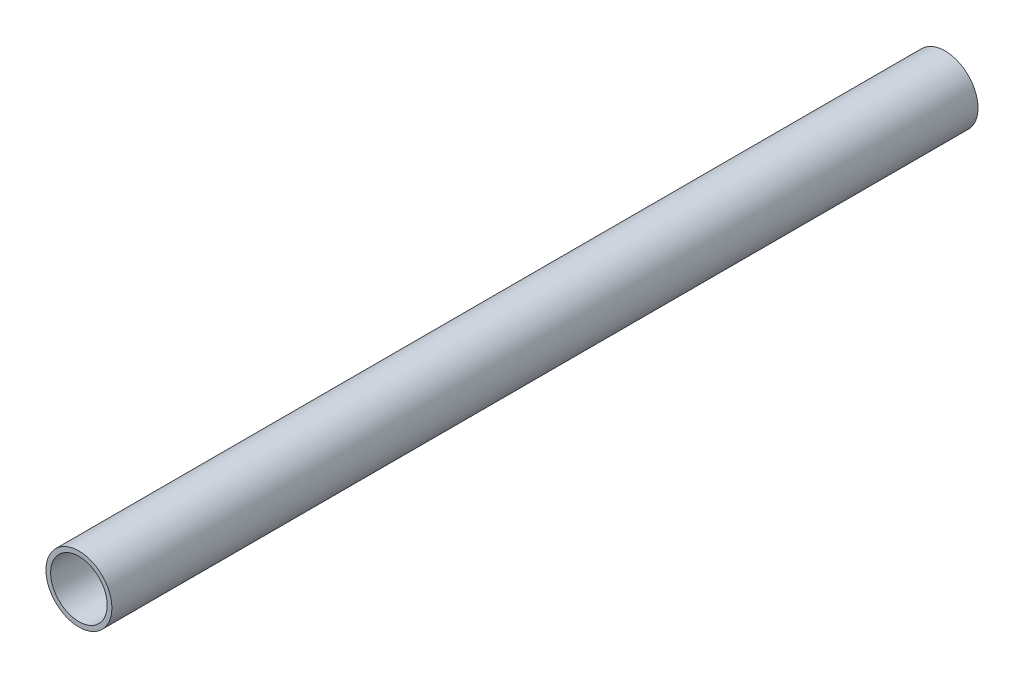
ISO-10303-21;
HEADER;
FILE_DESCRIPTION(('STEP AP214'),'2;1');
FILE_NAME('part.step','',(''),(''),'','','');
FILE_SCHEMA(('AUTOMOTIVE_DESIGN { 1 0 10303 214 1 1 1 1 }'));
ENDSEC;
DATA;
#1=APPLICATION_CONTEXT('core data for automotive mechanical design processes');
#2=APPLICATION_PROTOCOL_DEFINITION('international standard','automotive_design',2000,#1);
#3=PRODUCT_CONTEXT('',#1,'mechanical');
#4=PRODUCT('Part','Part','',(#3));
#5=PRODUCT_RELATED_PRODUCT_CATEGORY('part','',(#4));
#6=PRODUCT_DEFINITION_FORMATION('','',#4);
#7=PRODUCT_DEFINITION_CONTEXT('part definition',#1,'design');
#8=PRODUCT_DEFINITION('design','',#6,#7);
#9=PRODUCT_DEFINITION_SHAPE('','',#8);
#10=(LENGTH_UNIT() NAMED_UNIT(*) SI_UNIT(.MILLI.,.METRE.));
#11=(NAMED_UNIT(*) PLANE_ANGLE_UNIT() SI_UNIT($,.RADIAN.));
#12=(NAMED_UNIT(*) SI_UNIT($,.STERADIAN.) SOLID_ANGLE_UNIT());
#13=UNCERTAINTY_MEASURE_WITH_UNIT(LENGTH_MEASURE(1.E-05),#10,'distance_accuracy_value','');
#14=(GEOMETRIC_REPRESENTATION_CONTEXT(3) GLOBAL_UNCERTAINTY_ASSIGNED_CONTEXT((#13)) GLOBAL_UNIT_ASSIGNED_CONTEXT((#10,
#11,#12)) REPRESENTATION_CONTEXT('',''));
#15=CARTESIAN_POINT('',(0.,0.,0.));
#16=DIRECTION('',(0.,0.,1.));
#17=DIRECTION('',(1.,0.,0.));
#18=AXIS2_PLACEMENT_3D('',#15,#16,#17);
#19=CARTESIAN_POINT('',(0.,0.,330.2));
#20=DIRECTION('',(0.,0.,1.));
#21=DIRECTION('',(1.,0.,0.));
#22=AXIS2_PLACEMENT_3D('',#19,#20,#21);
#23=PLANE('',#22);
#24=CARTESIAN_POINT('',(0.,0.,330.2));
#25=DIRECTION('',(0.,0.,1.));
#26=DIRECTION('',(1.,0.,0.));
#27=AXIS2_PLACEMENT_3D('',#24,#25,#26);
#28=CIRCLE('',#27,12.573);
#29=CARTESIAN_POINT('',(12.573,0.,330.2));
#30=VERTEX_POINT('',#29);
#31=EDGE_CURVE('E10',#30,#30,#28,.T.);
#32=ORIENTED_EDGE('',*,*,#31,.T.);
#33=EDGE_LOOP('',(#32));
#34=FACE_BOUND('',#33,.T.);
#35=CARTESIAN_POINT('',(0.,0.,330.2));
#36=DIRECTION('',(0.,0.,1.));
#37=DIRECTION('',(1.,0.,0.));
#38=AXIS2_PLACEMENT_3D('',#35,#36,#37);
#39=CIRCLE('',#38,10.795);
#40=CARTESIAN_POINT('',(10.795,0.,330.2));
#41=VERTEX_POINT('',#40);
#42=EDGE_CURVE('E41',#41,#41,#39,.T.);
#43=ORIENTED_EDGE('',*,*,#42,.F.);
#44=EDGE_LOOP('',(#43));
#45=FACE_BOUND('',#44,.T.);
#46=ADVANCED_FACE('F30',(#34,#45),#23,.T.);
#47=CARTESIAN_POINT('',(0.,0.,0.));
#48=DIRECTION('',(0.,0.,1.));
#49=DIRECTION('',(1.,0.,0.));
#50=AXIS2_PLACEMENT_3D('',#47,#48,#49);
#51=PLANE('',#50);
#52=CARTESIAN_POINT('',(0.,0.,0.));
#53=DIRECTION('',(0.,0.,1.));
#54=DIRECTION('',(1.,0.,0.));
#55=AXIS2_PLACEMENT_3D('',#52,#53,#54);
#56=CIRCLE('',#55,12.573);
#57=CARTESIAN_POINT('',(12.573,0.,0.));
#58=VERTEX_POINT('',#57);
#59=EDGE_CURVE('E34',#58,#58,#56,.T.);
#60=ORIENTED_EDGE('',*,*,#59,.F.);
#61=EDGE_LOOP('',(#60));
#62=FACE_BOUND('',#61,.T.);
#63=CARTESIAN_POINT('',(0.,0.,0.));
#64=DIRECTION('',(0.,0.,1.));
#65=DIRECTION('',(1.,0.,0.));
#66=AXIS2_PLACEMENT_3D('',#63,#64,#65);
#67=CIRCLE('',#66,10.795);
#68=CARTESIAN_POINT('',(10.795,0.,0.));
#69=VERTEX_POINT('',#68);
#70=EDGE_CURVE('E43',#69,#69,#67,.T.);
#71=ORIENTED_EDGE('',*,*,#70,.T.);
#72=EDGE_LOOP('',(#71));
#73=FACE_BOUND('',#72,.T.);
#74=ADVANCED_FACE('F53',(#62,#73),#51,.F.);
#75=CARTESIAN_POINT('',(0.,0.,330.2));
#76=DIRECTION('',(0.,0.,-1.));
#77=DIRECTION('',(-1.,0.,0.));
#78=AXIS2_PLACEMENT_3D('',#75,#76,#77);
#79=CYLINDRICAL_SURFACE('',#78,12.573);
#80=ORIENTED_EDGE('',*,*,#31,.F.);
#81=EDGE_LOOP('',(#80));
#82=FACE_BOUND('',#81,.T.);
#83=ORIENTED_EDGE('',*,*,#59,.T.);
#84=EDGE_LOOP('',(#83));
#85=FACE_BOUND('',#84,.T.);
#86=ADVANCED_FACE('F32',(#82,#85),#79,.T.);
#87=CARTESIAN_POINT('',(0.,0.,330.2));
#88=DIRECTION('',(0.,0.,-1.));
#89=DIRECTION('',(-1.,0.,0.));
#90=AXIS2_PLACEMENT_3D('',#87,#88,#89);
#91=CYLINDRICAL_SURFACE('',#90,10.795);
#92=ORIENTED_EDGE('',*,*,#42,.T.);
#93=EDGE_LOOP('',(#92));
#94=FACE_BOUND('',#93,.T.);
#95=ORIENTED_EDGE('',*,*,#70,.F.);
#96=EDGE_LOOP('',(#95));
#97=FACE_BOUND('',#96,.T.);
#98=ADVANCED_FACE('F49',(#94,#97),#91,.F.);
#99=CLOSED_SHELL('',(#46,#74,#86,#98));
#100=MANIFOLD_SOLID_BREP('B2',#99);
#101=ADVANCED_BREP_SHAPE_REPRESENTATION('',(#18,#100),#14);
#102=SHAPE_DEFINITION_REPRESENTATION(#9,#101);
ENDSEC;
END-ISO-10303-21;
